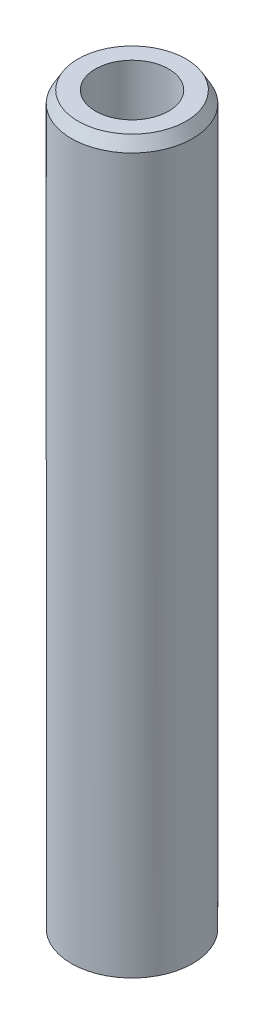
ISO-10303-21;
HEADER;
FILE_DESCRIPTION(('STEP AP214'),'2;1');
FILE_NAME('part.step','',(''),(''),'','','');
FILE_SCHEMA(('AUTOMOTIVE_DESIGN { 1 0 10303 214 1 1 1 1 }'));
ENDSEC;
DATA;
#1=APPLICATION_CONTEXT('core data for automotive mechanical design processes');
#2=APPLICATION_PROTOCOL_DEFINITION('international standard','automotive_design',2000,#1);
#3=PRODUCT_CONTEXT('',#1,'mechanical');
#4=PRODUCT('Part','Part','',(#3));
#5=PRODUCT_RELATED_PRODUCT_CATEGORY('part','',(#4));
#6=PRODUCT_DEFINITION_FORMATION('','',#4);
#7=PRODUCT_DEFINITION_CONTEXT('part definition',#1,'design');
#8=PRODUCT_DEFINITION('design','',#6,#7);
#9=PRODUCT_DEFINITION_SHAPE('','',#8);
#10=(LENGTH_UNIT() NAMED_UNIT(*) SI_UNIT(.MILLI.,.METRE.));
#11=(NAMED_UNIT(*) PLANE_ANGLE_UNIT() SI_UNIT($,.RADIAN.));
#12=(NAMED_UNIT(*) SI_UNIT($,.STERADIAN.) SOLID_ANGLE_UNIT());
#13=UNCERTAINTY_MEASURE_WITH_UNIT(LENGTH_MEASURE(1.E-05),#10,'distance_accuracy_value','');
#14=(GEOMETRIC_REPRESENTATION_CONTEXT(3) GLOBAL_UNCERTAINTY_ASSIGNED_CONTEXT((#13)) GLOBAL_UNIT_ASSIGNED_CONTEXT((#10,
#11,#12)) REPRESENTATION_CONTEXT('',''));
#15=CARTESIAN_POINT('',(0.,0.,0.));
#16=DIRECTION('',(0.,0.,1.));
#17=DIRECTION('',(1.,0.,0.));
#18=AXIS2_PLACEMENT_3D('',#15,#16,#17);
#19=CARTESIAN_POINT('',(0.,120.703174789594,0.));
#20=DIRECTION('',(0.,-1.,0.));
#21=DIRECTION('',(0.,0.,-1.));
#22=AXIS2_PLACEMENT_3D('',#19,#20,#21);
#23=CYLINDRICAL_SURFACE('',#22,10.);
#24=CARTESIAN_POINT('',(0.,118.788251377113,0.));
#25=DIRECTION('',(0.,1.,0.));
#26=DIRECTION('',(0.,0.,1.));
#27=AXIS2_PLACEMENT_3D('',#24,#25,#26);
#28=CIRCLE('',#27,10.);
#29=CARTESIAN_POINT('',(0.,118.788251377113,-10.));
#30=VERTEX_POINT('',#29);
#31=EDGE_CURVE('E50',#30,#30,#28,.F.);
#32=ORIENTED_EDGE('',*,*,#31,.T.);
#33=EDGE_LOOP('',(#32));
#34=FACE_BOUND('',#33,.T.);
#35=CARTESIAN_POINT('',(0.,1.10558154767351,0.));
#36=DIRECTION('',(0.,1.,0.));
#37=DIRECTION('',(0.,0.,1.));
#38=AXIS2_PLACEMENT_3D('',#35,#36,#37);
#39=CIRCLE('',#38,10.);
#40=CARTESIAN_POINT('',(0.,1.10558154767351,10.));
#41=VERTEX_POINT('',#40);
#42=EDGE_CURVE('E51',#41,#41,#39,.T.);
#43=ORIENTED_EDGE('',*,*,#42,.T.);
#44=EDGE_LOOP('',(#43));
#45=FACE_BOUND('',#44,.T.);
#46=ADVANCED_FACE('F39',(#34,#45),#23,.T.);
#47=CARTESIAN_POINT('',(0.,120.703174789594,0.));
#48=DIRECTION('',(0.,1.,0.));
#49=DIRECTION('',(0.,0.,1.));
#50=AXIS2_PLACEMENT_3D('',#47,#48,#49);
#51=PLANE('',#50);
#52=CARTESIAN_POINT('',(0.,120.703174789594,0.));
#53=DIRECTION('',(0.,1.,0.));
#54=DIRECTION('',(0.,0.,1.));
#55=AXIS2_PLACEMENT_3D('',#52,#53,#54);
#56=CIRCLE('',#55,8.89441845232647);
#57=CARTESIAN_POINT('',(0.,120.703174789594,-8.89441845232647));
#58=VERTEX_POINT('',#57);
#59=EDGE_CURVE('E54',#58,#58,#56,.T.);
#60=ORIENTED_EDGE('',*,*,#59,.T.);
#61=EDGE_LOOP('',(#60));
#62=FACE_BOUND('',#61,.T.);
#63=CARTESIAN_POINT('',(0.,120.703174789594,0.));
#64=DIRECTION('',(0.,1.,0.));
#65=DIRECTION('',(0.,0.,1.));
#66=AXIS2_PLACEMENT_3D('',#63,#64,#65);
#67=CIRCLE('',#66,6.02590495724289);
#68=CARTESIAN_POINT('',(0.,120.703174789594,6.02590495724289));
#69=VERTEX_POINT('',#68);
#70=EDGE_CURVE('E58',#69,#69,#67,.T.);
#71=ORIENTED_EDGE('',*,*,#70,.F.);
#72=EDGE_LOOP('',(#71));
#73=FACE_BOUND('',#72,.T.);
#74=ADVANCED_FACE('F69',(#62,#73),#51,.T.);
#75=CARTESIAN_POINT('',(0.,0.,0.));
#76=DIRECTION('',(0.,1.,0.));
#77=DIRECTION('',(0.,0.,1.));
#78=AXIS2_PLACEMENT_3D('',#75,#76,#77);
#79=PLANE('',#78);
#80=CARTESIAN_POINT('',(0.,0.,0.));
#81=DIRECTION('',(0.,1.,0.));
#82=DIRECTION('',(0.,0.,1.));
#83=AXIS2_PLACEMENT_3D('',#80,#81,#82);
#84=CIRCLE('',#83,8.08507658751885);
#85=CARTESIAN_POINT('',(0.,0.,8.08507658751885));
#86=VERTEX_POINT('',#85);
#87=EDGE_CURVE('E10',#86,#86,#84,.F.);
#88=ORIENTED_EDGE('',*,*,#87,.T.);
#89=EDGE_LOOP('',(#88));
#90=FACE_BOUND('',#89,.T.);
#91=CARTESIAN_POINT('',(0.,0.,0.));
#92=DIRECTION('',(0.,1.,0.));
#93=DIRECTION('',(0.,0.,1.));
#94=AXIS2_PLACEMENT_3D('',#91,#92,#93);
#95=CIRCLE('',#94,6.02590495724289);
#96=CARTESIAN_POINT('',(0.,0.,6.02590495724289));
#97=VERTEX_POINT('',#96);
#98=EDGE_CURVE('E63',#97,#97,#95,.T.);
#99=ORIENTED_EDGE('',*,*,#98,.T.);
#100=EDGE_LOOP('',(#99));
#101=FACE_BOUND('',#100,.T.);
#102=ADVANCED_FACE('F75',(#90,#101),#79,.F.);
#103=CARTESIAN_POINT('',(0.,120.703174789594,0.));
#104=DIRECTION('',(0.,-1.,0.));
#105=DIRECTION('',(0.,0.,-1.));
#106=AXIS2_PLACEMENT_3D('',#103,#104,#105);
#107=CYLINDRICAL_SURFACE('',#106,6.02590495724289);
#108=ORIENTED_EDGE('',*,*,#70,.T.);
#109=EDGE_LOOP('',(#108));
#110=FACE_BOUND('',#109,.T.);
#111=ORIENTED_EDGE('',*,*,#98,.F.);
#112=EDGE_LOOP('',(#111));
#113=FACE_BOUND('',#112,.T.);
#114=ADVANCED_FACE('F70',(#110,#113),#107,.F.);
#115=CARTESIAN_POINT('',(0.,120.703174789594,0.));
#116=DIRECTION('',(0.,-1.,0.));
#117=DIRECTION('',(0.,0.,-1.));
#118=AXIS2_PLACEMENT_3D('',#115,#116,#117);
#119=CONICAL_SURFACE('',#118,8.89441845232647,0.523598775598296);
#120=CARTESIAN_POINT('',(0.,118.788251377113,-10.));
#121=CARTESIAN_POINT('',(0.,118.808198495993,-9.98848352554507));
#122=CARTESIAN_POINT('',(0.,118.828145614873,-9.97696705109014));
#123=CARTESIAN_POINT('',(0.,118.868039852633,-9.95393410218027));
#124=CARTESIAN_POINT('',(0.,118.887986971513,-9.94241762772534));
#125=CARTESIAN_POINT('',(0.,118.927881209273,-9.91938467881548));
#126=CARTESIAN_POINT('',(0.,118.947828328153,-9.90786820436055));
#127=CARTESIAN_POINT('',(0.,118.987722565913,-9.88483525545068));
#128=CARTESIAN_POINT('',(0.,119.007669684793,-9.87331878099574));
#129=CARTESIAN_POINT('',(0.,119.047563922553,-9.85028583208588));
#130=CARTESIAN_POINT('',(0.,119.067511041433,-9.83876935763095));
#131=CARTESIAN_POINT('',(0.,119.107405279193,-9.81573640872108));
#132=CARTESIAN_POINT('',(0.,119.127352398074,-9.80421993426615));
#133=CARTESIAN_POINT('',(0.,119.167246635834,-9.78118698535629));
#134=CARTESIAN_POINT('',(0.,119.187193754714,-9.76967051090135));
#135=CARTESIAN_POINT('',(0.,119.227087992474,-9.74663756199149));
#136=CARTESIAN_POINT('',(0.,119.247035111354,-9.73512108753655));
#137=CARTESIAN_POINT('',(0.,119.286929349114,-9.71208813862669));
#138=CARTESIAN_POINT('',(0.,119.306876467994,-9.70057166417176));
#139=CARTESIAN_POINT('',(0.,119.346770705754,-9.67753871526189));
#140=CARTESIAN_POINT('',(0.,119.366717824634,-9.66602224080696));
#141=CARTESIAN_POINT('',(0.,119.406612062394,-9.64298929189709));
#142=CARTESIAN_POINT('',(0.,119.426559181274,-9.63147281744216));
#143=CARTESIAN_POINT('',(0.,119.466453419034,-9.6084398685323));
#144=CARTESIAN_POINT('',(0.,119.486400537914,-9.59692339407736));
#145=CARTESIAN_POINT('',(0.,119.526294775674,-9.5738904451675));
#146=CARTESIAN_POINT('',(0.,119.546241894554,-9.56237397071256));
#147=CARTESIAN_POINT('',(0.,119.586136132314,-9.5393410218027));
#148=CARTESIAN_POINT('',(0.,119.606083251194,-9.52782454734777));
#149=CARTESIAN_POINT('',(0.,119.645977488954,-9.5047915984379));
#150=CARTESIAN_POINT('',(0.,119.665924607834,-9.49327512398297));
#151=CARTESIAN_POINT('',(0.,119.705818845594,-9.47024217507311));
#152=CARTESIAN_POINT('',(0.,119.725765964474,-9.45872570061817));
#153=CARTESIAN_POINT('',(0.,119.765660202234,-9.43569275170831));
#154=CARTESIAN_POINT('',(0.,119.785607321114,-9.42417627725338));
#155=CARTESIAN_POINT('',(0.,119.825501558874,-9.40114332834351));
#156=CARTESIAN_POINT('',(0.,119.845448677754,-9.38962685388858));
#157=CARTESIAN_POINT('',(0.,119.885342915514,-9.36659390497871));
#158=CARTESIAN_POINT('',(0.,119.905290034394,-9.35507743052378));
#159=CARTESIAN_POINT('',(0.,119.945184272154,-9.33204448161391));
#160=CARTESIAN_POINT('',(0.,119.965131391034,-9.32052800715898));
#161=CARTESIAN_POINT('',(0.,120.005025628794,-9.29749505824912));
#162=CARTESIAN_POINT('',(0.,120.024972747674,-9.28597858379418));
#163=CARTESIAN_POINT('',(0.,120.064866985434,-9.26294563488432));
#164=CARTESIAN_POINT('',(0.,120.084814104314,-9.25142916042939));
#165=CARTESIAN_POINT('',(0.,120.124708342074,-9.22839621151952));
#166=CARTESIAN_POINT('',(0.,120.144655460954,-9.21687973706459));
#167=CARTESIAN_POINT('',(0.,120.184549698714,-9.19384678815472));
#168=CARTESIAN_POINT('',(0.,120.204496817594,-9.18233031369979));
#169=CARTESIAN_POINT('',(0.,120.244391055354,-9.15929736478992));
#170=CARTESIAN_POINT('',(0.,120.264338174234,-9.14778089033499));
#171=CARTESIAN_POINT('',(0.,120.304232411994,-9.12474794142513));
#172=CARTESIAN_POINT('',(0.,120.324179530874,-9.11323146697019));
#173=CARTESIAN_POINT('',(0.,120.364073768634,-9.09019851806033));
#174=CARTESIAN_POINT('',(0.,120.384020887514,-9.0786820436054));
#175=CARTESIAN_POINT('',(0.,120.423915125274,-9.05564909469553));
#176=CARTESIAN_POINT('',(0.,120.443862244154,-9.0441326202406));
#177=CARTESIAN_POINT('',(0.,120.483756481914,-9.02109967133073));
#178=CARTESIAN_POINT('',(0.,120.503703600794,-9.0095831968758));
#179=CARTESIAN_POINT('',(0.,120.543597838554,-8.98655024796593));
#180=CARTESIAN_POINT('',(0.,120.563544957434,-8.975033773511));
#181=CARTESIAN_POINT('',(0.,120.603439195194,-8.95200082460114));
#182=CARTESIAN_POINT('',(0.,120.623386314074,-8.9404843501462));
#183=CARTESIAN_POINT('',(0.,120.663280551834,-8.91745140123634));
#184=CARTESIAN_POINT('',(0.,120.683227670714,-8.9059349267814));
#185=CARTESIAN_POINT('',(0.,120.703174789594,-8.89441845232647));
#186=B_SPLINE_CURVE_WITH_KNOTS('',3,(#120,#121,#122,#123,#124,#125,#126,#127,#128,#129,#130,
#131,#132,#133,#134,#135,#136,#137,#138,#139,#140,#141,#142,#143,#144,#145,#146,#147,#148,#149,
#150,#151,#152,#153,#154,#155,#156,#157,#158,#159,#160,#161,#162,#163,#164,#165,#166,#167,#168,
#169,#170,#171,#172,#173,#174,#175,#176,#177,#178,#179,#180,#181,#182,#183,#184,#185),
.UNSPECIFIED.,.F.,.F.,(4,2,2,2,2,2,2,2,2,2,2,2,2,2,2,2,2,2,2,2,2,2,2,2,2,2,2,2,2,2,2,2,4),(0.,
0.0690988467295999,0.1381976934592,0.2072965401888,0.276395386918388,0.345494233647988,
0.414593080377587,0.483691927107174,0.552790773836774,0.621889620566374,0.690988467295962,
0.760087314025562,0.829186160755162,0.89828500748475,0.967383854214349,1.03648270094395,
1.10558154767354,1.17468039440314,1.24377924113274,1.31287808786234,1.38197693459192,
1.45107578132152,1.52017462805112,1.58927347478071,1.65837232151031,1.72747116823991,
1.7965700149695,1.8656688616991,1.9347677084287,2.00386655515829,2.07296540188789,
2.14206424861749,2.21116309534709),.UNSPECIFIED.);
#187=EDGE_CURVE('BSEAM81',#30,#58,#186,.T.);
#188=ORIENTED_EDGE('',*,*,#31,.F.);
#189=ORIENTED_EDGE('',*,*,#59,.F.);
#190=ORIENTED_EDGE('',*,*,#187,.T.);
#191=ORIENTED_EDGE('',*,*,#187,.F.);
#192=EDGE_LOOP('',(#188,#190,#189,#191));
#193=FACE_BOUND('',#192,.T.);
#194=ADVANCED_FACE('F81',(#193),#119,.T.);
#195=CARTESIAN_POINT('',(0.,1.10558154767351,0.));
#196=DIRECTION('',(0.,1.,0.));
#197=DIRECTION('',(0.,0.,1.));
#198=AXIS2_PLACEMENT_3D('',#195,#196,#197);
#199=CONICAL_SURFACE('',#198,10.,1.0471975511966);
#200=ORIENTED_EDGE('',*,*,#87,.F.);
#201=EDGE_LOOP('',(#200));
#202=FACE_BOUND('',#201,.T.);
#203=ORIENTED_EDGE('',*,*,#42,.F.);
#204=EDGE_LOOP('',(#203));
#205=FACE_BOUND('',#204,.T.);
#206=ADVANCED_FACE('F45',(#202,#205),#199,.T.);
#207=CLOSED_SHELL('',(#46,#74,#102,#114,#194,#206));
#208=MANIFOLD_SOLID_BREP('B2',#207);
#209=ADVANCED_BREP_SHAPE_REPRESENTATION('',(#18,#208),#14);
#210=SHAPE_DEFINITION_REPRESENTATION(#9,#209);
ENDSEC;
END-ISO-10303-21;
